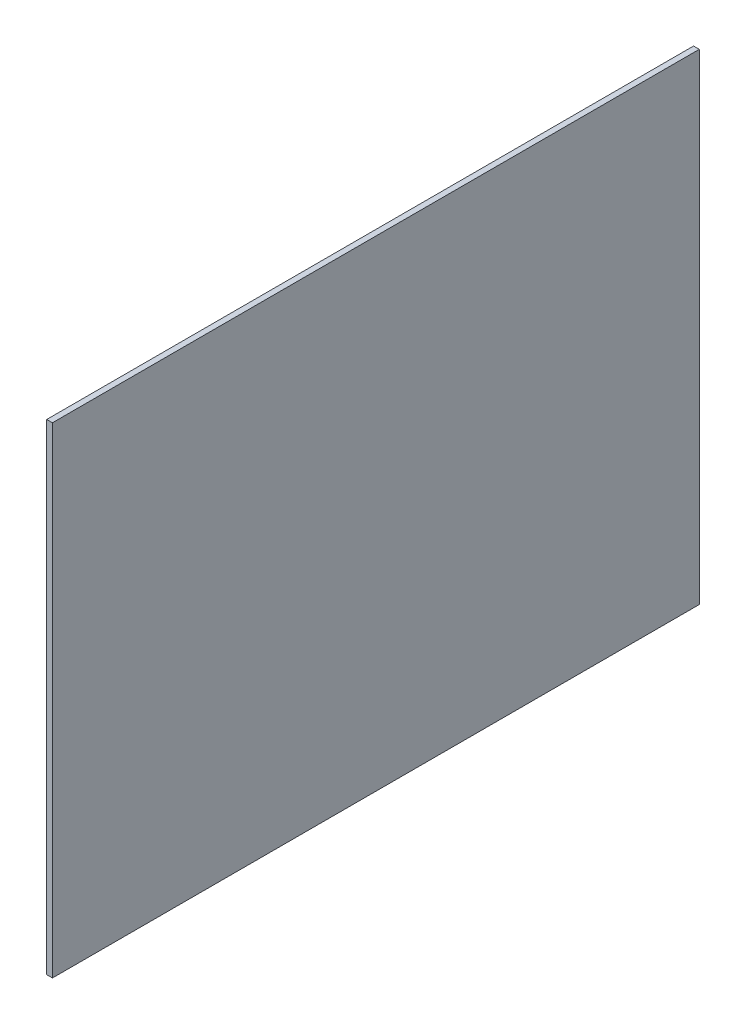
ISO-10303-21;
HEADER;
FILE_DESCRIPTION(('STEP AP214'),'2;1');
FILE_NAME('part.step','',(''),(''),'','','');
FILE_SCHEMA(('AUTOMOTIVE_DESIGN { 1 0 10303 214 1 1 1 1 }'));
ENDSEC;
DATA;
#1=APPLICATION_CONTEXT('core data for automotive mechanical design processes');
#2=APPLICATION_PROTOCOL_DEFINITION('international standard','automotive_design',2000,#1);
#3=PRODUCT_CONTEXT('',#1,'mechanical');
#4=PRODUCT('Part','Part','',(#3));
#5=PRODUCT_RELATED_PRODUCT_CATEGORY('part','',(#4));
#6=PRODUCT_DEFINITION_FORMATION('','',#4);
#7=PRODUCT_DEFINITION_CONTEXT('part definition',#1,'design');
#8=PRODUCT_DEFINITION('design','',#6,#7);
#9=PRODUCT_DEFINITION_SHAPE('','',#8);
#10=(LENGTH_UNIT() NAMED_UNIT(*) SI_UNIT(.MILLI.,.METRE.));
#11=(NAMED_UNIT(*) PLANE_ANGLE_UNIT() SI_UNIT($,.RADIAN.));
#12=(NAMED_UNIT(*) SI_UNIT($,.STERADIAN.) SOLID_ANGLE_UNIT());
#13=UNCERTAINTY_MEASURE_WITH_UNIT(LENGTH_MEASURE(1.E-05),#10,'distance_accuracy_value','');
#14=(GEOMETRIC_REPRESENTATION_CONTEXT(3) GLOBAL_UNCERTAINTY_ASSIGNED_CONTEXT((#13)) GLOBAL_UNIT_ASSIGNED_CONTEXT((#10,
#11,#12)) REPRESENTATION_CONTEXT('',''));
#15=CARTESIAN_POINT('',(0.,0.,0.));
#16=DIRECTION('',(0.,0.,1.));
#17=DIRECTION('',(1.,0.,0.));
#18=AXIS2_PLACEMENT_3D('',#15,#16,#17);
#19=CARTESIAN_POINT('',(-193.,239.840100222647,0.));
#20=DIRECTION('',(0.,0.,-1.));
#21=DIRECTION('',(-1.,0.,0.));
#22=AXIS2_PLACEMENT_3D('',#19,#20,#21);
#23=PLANE('',#22);
#24=DIRECTION('',(0.,-1.,0.));
#25=VECTOR('',#24,1.);
#26=CARTESIAN_POINT('',(-195.,239.840100222647,0.));
#27=LINE('',#26,#25);
#28=CARTESIAN_POINT('',(-195.,239.840100222647,0.));
#29=VERTEX_POINT('',#28);
#30=CARTESIAN_POINT('',(-195.,71.8401002226474,0.));
#31=VERTEX_POINT('',#30);
#32=EDGE_CURVE('E110',#29,#31,#27,.T.);
#33=ORIENTED_EDGE('',*,*,#32,.T.);
#34=DIRECTION('',(-1.,0.,0.));
#35=VECTOR('',#34,1.);
#36=CARTESIAN_POINT('',(-193.,71.8401002226474,0.));
#37=LINE('',#36,#35);
#38=CARTESIAN_POINT('',(-193.,71.8401002226474,0.));
#39=VERTEX_POINT('',#38);
#40=EDGE_CURVE('E11',#39,#31,#37,.T.);
#41=ORIENTED_EDGE('',*,*,#40,.F.);
#42=DIRECTION('',(0.,-1.,0.));
#43=VECTOR('',#42,1.);
#44=CARTESIAN_POINT('',(-193.,239.840100222647,0.));
#45=LINE('',#44,#43);
#46=CARTESIAN_POINT('',(-193.,239.840100222647,0.));
#47=VERTEX_POINT('',#46);
#48=EDGE_CURVE('E93',#47,#39,#45,.T.);
#49=ORIENTED_EDGE('',*,*,#48,.F.);
#50=DIRECTION('',(-1.,0.,0.));
#51=VECTOR('',#50,1.);
#52=CARTESIAN_POINT('',(-193.,239.840100222647,0.));
#53=LINE('',#52,#51);
#54=EDGE_CURVE('E106',#47,#29,#53,.T.);
#55=ORIENTED_EDGE('',*,*,#54,.T.);
#56=EDGE_LOOP('',(#33,#41,#49,#55));
#57=FACE_BOUND('',#56,.T.);
#58=ADVANCED_FACE('F41',(#57),#23,.F.);
#59=CARTESIAN_POINT('',(-193.,71.8401002226474,0.));
#60=DIRECTION('',(0.,1.,0.));
#61=DIRECTION('',(0.,0.,1.));
#62=AXIS2_PLACEMENT_3D('',#59,#60,#61);
#63=PLANE('',#62);
#64=DIRECTION('',(0.,0.,-1.));
#65=VECTOR('',#64,1.);
#66=CARTESIAN_POINT('',(-195.,71.8401002226474,0.));
#67=LINE('',#66,#65);
#68=CARTESIAN_POINT('',(-195.,71.8401002226474,-226.));
#69=VERTEX_POINT('',#68);
#70=EDGE_CURVE('E98',#31,#69,#67,.T.);
#71=ORIENTED_EDGE('',*,*,#70,.T.);
#72=DIRECTION('',(-1.,0.,0.));
#73=VECTOR('',#72,1.);
#74=CARTESIAN_POINT('',(-193.,71.8401002226474,-226.));
#75=LINE('',#74,#73);
#76=CARTESIAN_POINT('',(-193.,71.8401002226474,-226.));
#77=VERTEX_POINT('',#76);
#78=EDGE_CURVE('E50',#77,#69,#75,.T.);
#79=ORIENTED_EDGE('',*,*,#78,.F.);
#80=DIRECTION('',(0.,0.,-1.));
#81=VECTOR('',#80,1.);
#82=CARTESIAN_POINT('',(-193.,71.8401002226474,0.));
#83=LINE('',#82,#81);
#84=EDGE_CURVE('E88',#39,#77,#83,.T.);
#85=ORIENTED_EDGE('',*,*,#84,.F.);
#86=ORIENTED_EDGE('',*,*,#40,.T.);
#87=EDGE_LOOP('',(#71,#79,#85,#86));
#88=FACE_BOUND('',#87,.T.);
#89=ADVANCED_FACE('F97',(#88),#63,.F.);
#90=CARTESIAN_POINT('',(-193.,239.840100222647,-226.));
#91=DIRECTION('',(0.,0.,1.));
#92=DIRECTION('',(0.,-1.,0.));
#93=AXIS2_PLACEMENT_3D('',#90,#91,#92);
#94=PLANE('',#93);
#95=DIRECTION('',(0.,1.,0.));
#96=VECTOR('',#95,1.);
#97=CARTESIAN_POINT('',(-195.,239.840100222647,-226.));
#98=LINE('',#97,#96);
#99=CARTESIAN_POINT('',(-195.,239.840100222647,-226.));
#100=VERTEX_POINT('',#99);
#101=EDGE_CURVE('E75',#69,#100,#98,.T.);
#102=ORIENTED_EDGE('',*,*,#101,.T.);
#103=DIRECTION('',(-1.,0.,0.));
#104=VECTOR('',#103,1.);
#105=CARTESIAN_POINT('',(-193.,239.840100222647,-226.));
#106=LINE('',#105,#104);
#107=CARTESIAN_POINT('',(-193.,239.840100222647,-226.));
#108=VERTEX_POINT('',#107);
#109=EDGE_CURVE('E100',#108,#100,#106,.T.);
#110=ORIENTED_EDGE('',*,*,#109,.F.);
#111=DIRECTION('',(0.,1.,0.));
#112=VECTOR('',#111,1.);
#113=CARTESIAN_POINT('',(-193.,239.840100222647,-226.));
#114=LINE('',#113,#112);
#115=EDGE_CURVE('E91',#77,#108,#114,.T.);
#116=ORIENTED_EDGE('',*,*,#115,.F.);
#117=ORIENTED_EDGE('',*,*,#78,.T.);
#118=EDGE_LOOP('',(#102,#110,#116,#117));
#119=FACE_BOUND('',#118,.T.);
#120=ADVANCED_FACE('F101',(#119),#94,.F.);
#121=CARTESIAN_POINT('',(-193.,239.840100222647,0.));
#122=DIRECTION('',(0.,-1.,0.));
#123=DIRECTION('',(0.,0.,-1.));
#124=AXIS2_PLACEMENT_3D('',#121,#122,#123);
#125=PLANE('',#124);
#126=DIRECTION('',(0.,0.,1.));
#127=VECTOR('',#126,1.);
#128=CARTESIAN_POINT('',(-195.,239.840100222647,0.));
#129=LINE('',#128,#127);
#130=EDGE_CURVE('E81',#100,#29,#129,.T.);
#131=ORIENTED_EDGE('',*,*,#130,.T.);
#132=ORIENTED_EDGE('',*,*,#54,.F.);
#133=DIRECTION('',(0.,0.,1.));
#134=VECTOR('',#133,1.);
#135=CARTESIAN_POINT('',(-193.,239.840100222647,0.));
#136=LINE('',#135,#134);
#137=EDGE_CURVE('E58',#108,#47,#136,.T.);
#138=ORIENTED_EDGE('',*,*,#137,.F.);
#139=ORIENTED_EDGE('',*,*,#109,.T.);
#140=EDGE_LOOP('',(#131,#132,#138,#139));
#141=FACE_BOUND('',#140,.T.);
#142=ADVANCED_FACE('F125',(#141),#125,.F.);
#143=CARTESIAN_POINT('',(-193.,0.,0.));
#144=DIRECTION('',(1.,0.,0.));
#145=DIRECTION('',(0.,0.,-1.));
#146=AXIS2_PLACEMENT_3D('',#143,#144,#145);
#147=PLANE('',#146);
#148=ORIENTED_EDGE('',*,*,#48,.T.);
#149=ORIENTED_EDGE('',*,*,#84,.T.);
#150=ORIENTED_EDGE('',*,*,#115,.T.);
#151=ORIENTED_EDGE('',*,*,#137,.T.);
#152=EDGE_LOOP('',(#148,#149,#150,#151));
#153=FACE_BOUND('',#152,.T.);
#154=ADVANCED_FACE('F89',(#153),#147,.T.);
#155=CARTESIAN_POINT('',(-195.,0.,0.));
#156=DIRECTION('',(1.,0.,0.));
#157=DIRECTION('',(0.,0.,-1.));
#158=AXIS2_PLACEMENT_3D('',#155,#156,#157);
#159=PLANE('',#158);
#160=ORIENTED_EDGE('',*,*,#32,.F.);
#161=ORIENTED_EDGE('',*,*,#130,.F.);
#162=ORIENTED_EDGE('',*,*,#101,.F.);
#163=ORIENTED_EDGE('',*,*,#70,.F.);
#164=EDGE_LOOP('',(#160,#161,#162,#163));
#165=FACE_BOUND('',#164,.T.);
#166=ADVANCED_FACE('F128',(#165),#159,.F.);
#167=CLOSED_SHELL('',(#58,#89,#120,#142,#154,#166));
#168=MANIFOLD_SOLID_BREP('B2',#167);
#169=ADVANCED_BREP_SHAPE_REPRESENTATION('',(#18,#168),#14);
#170=SHAPE_DEFINITION_REPRESENTATION(#9,#169);
ENDSEC;
END-ISO-10303-21;
